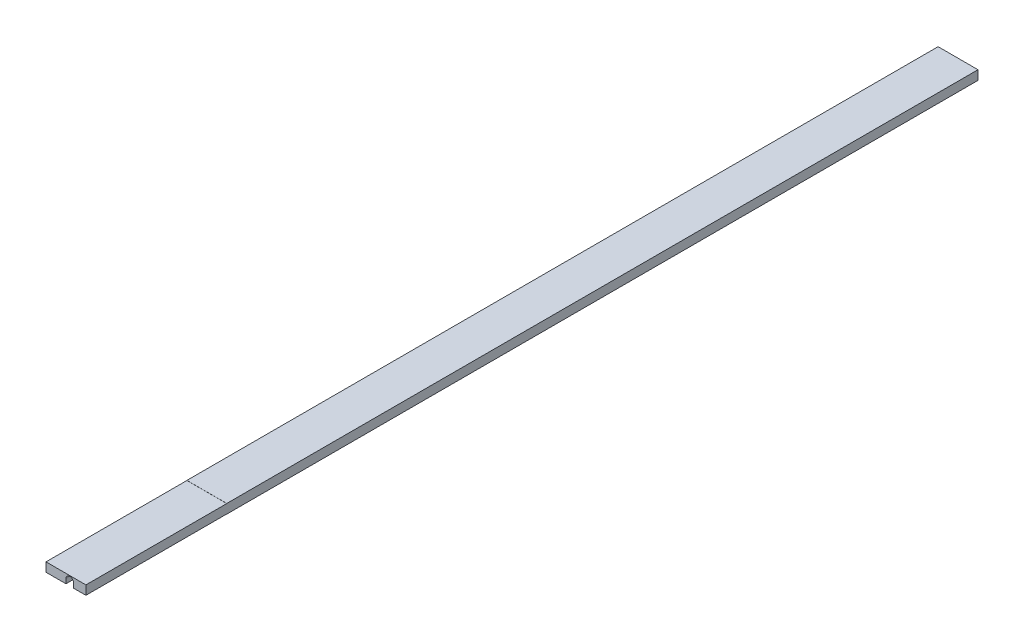
ISO-10303-21;
HEADER;
FILE_DESCRIPTION(('STEP AP214'),'2;1');
FILE_NAME('part.step','',(''),(''),'','','');
FILE_SCHEMA(('AUTOMOTIVE_DESIGN { 1 0 10303 214 1 1 1 1 }'));
ENDSEC;
DATA;
#1=APPLICATION_CONTEXT('core data for automotive mechanical design processes');
#2=APPLICATION_PROTOCOL_DEFINITION('international standard','automotive_design',2000,#1);
#3=PRODUCT_CONTEXT('',#1,'mechanical');
#4=PRODUCT('Part','Part','',(#3));
#5=PRODUCT_RELATED_PRODUCT_CATEGORY('part','',(#4));
#6=PRODUCT_DEFINITION_FORMATION('','',#4);
#7=PRODUCT_DEFINITION_CONTEXT('part definition',#1,'design');
#8=PRODUCT_DEFINITION('design','',#6,#7);
#9=PRODUCT_DEFINITION_SHAPE('','',#8);
#10=(LENGTH_UNIT() NAMED_UNIT(*) SI_UNIT(.MILLI.,.METRE.));
#11=(NAMED_UNIT(*) PLANE_ANGLE_UNIT() SI_UNIT($,.RADIAN.));
#12=(NAMED_UNIT(*) SI_UNIT($,.STERADIAN.) SOLID_ANGLE_UNIT());
#13=UNCERTAINTY_MEASURE_WITH_UNIT(LENGTH_MEASURE(1.E-05),#10,'distance_accuracy_value','');
#14=(GEOMETRIC_REPRESENTATION_CONTEXT(3) GLOBAL_UNCERTAINTY_ASSIGNED_CONTEXT((#13)) GLOBAL_UNIT_ASSIGNED_CONTEXT((#10,
#11,#12)) REPRESENTATION_CONTEXT('',''));
#15=CARTESIAN_POINT('',(0.,0.,0.));
#16=DIRECTION('',(0.,0.,1.));
#17=DIRECTION('',(1.,0.,0.));
#18=AXIS2_PLACEMENT_3D('',#15,#16,#17);
#19=CARTESIAN_POINT('',(-12.5,-2.9,259.4));
#20=DIRECTION('',(0.,1.,0.));
#21=DIRECTION('',(0.,0.,1.));
#22=AXIS2_PLACEMENT_3D('',#19,#20,#21);
#23=PLANE('',#22);
#24=DIRECTION('',(0.,0.,-1.));
#25=VECTOR('',#24,1.);
#26=CARTESIAN_POINT('',(12.5,-2.9,259.4));
#27=LINE('',#26,#25);
#28=CARTESIAN_POINT('',(12.5,-2.90000000000001,191.15));
#29=VERTEX_POINT('',#28);
#30=CARTESIAN_POINT('',(12.5,-2.9,-279.4));
#31=VERTEX_POINT('',#30);
#32=EDGE_CURVE('E172',#29,#31,#27,.T.);
#33=ORIENTED_EDGE('',*,*,#32,.F.);
#34=DIRECTION('',(-1.,0.,0.));
#35=VECTOR('',#34,1.);
#36=CARTESIAN_POINT('',(12.5,-2.90000000000001,191.15));
#37=LINE('',#36,#35);
#38=CARTESIAN_POINT('',(4.76224999999999,-2.90000000000001,191.15));
#39=VERTEX_POINT('',#38);
#40=EDGE_CURVE('E205',#29,#39,#37,.T.);
#41=ORIENTED_EDGE('',*,*,#40,.T.);
#42=DIRECTION('',(0.,0.,1.));
#43=VECTOR('',#42,1.);
#44=CARTESIAN_POINT('',(4.76224999999999,-2.9,-279.4));
#45=LINE('',#44,#43);
#46=CARTESIAN_POINT('',(4.76224999999999,-2.9,-279.4));
#47=VERTEX_POINT('',#46);
#48=EDGE_CURVE('E238',#47,#39,#45,.T.);
#49=ORIENTED_EDGE('',*,*,#48,.F.);
#50=DIRECTION('',(1.,0.,0.));
#51=VECTOR('',#50,1.);
#52=CARTESIAN_POINT('',(-12.5,-2.9,-279.4));
#53=LINE('',#52,#51);
#54=EDGE_CURVE('E173',#47,#31,#53,.T.);
#55=ORIENTED_EDGE('',*,*,#54,.T.);
#56=EDGE_LOOP('',(#33,#41,#49,#55));
#57=FACE_BOUND('',#56,.T.);
#58=ADVANCED_FACE('F34',(#57),#23,.F.);
#59=CARTESIAN_POINT('',(12.5,2.9,259.4));
#60=DIRECTION('',(-1.,0.,0.));
#61=DIRECTION('',(0.,0.,1.));
#62=AXIS2_PLACEMENT_3D('',#59,#60,#61);
#63=PLANE('',#62);
#64=DIRECTION('',(0.,0.,-1.));
#65=VECTOR('',#64,1.);
#66=CARTESIAN_POINT('',(12.5,-2.83142,279.4));
#67=LINE('',#66,#65);
#68=CARTESIAN_POINT('',(12.5,-2.83142,279.4));
#69=VERTEX_POINT('',#68);
#70=CARTESIAN_POINT('',(12.5,-2.83142000000001,191.15));
#71=VERTEX_POINT('',#70);
#72=EDGE_CURVE('E133',#69,#71,#67,.T.);
#73=ORIENTED_EDGE('',*,*,#72,.T.);
#74=DIRECTION('',(0.,-1.,0.));
#75=VECTOR('',#74,1.);
#76=CARTESIAN_POINT('',(12.5,-2.90000000000001,191.15));
#77=LINE('',#76,#75);
#78=EDGE_CURVE('E141',#71,#29,#77,.T.);
#79=ORIENTED_EDGE('',*,*,#78,.T.);
#80=ORIENTED_EDGE('',*,*,#32,.T.);
#81=DIRECTION('',(0.,1.,0.));
#82=VECTOR('',#81,1.);
#83=CARTESIAN_POINT('',(12.5,-34.9156211871643,-279.4));
#84=LINE('',#83,#82);
#85=CARTESIAN_POINT('',(12.5,2.9,-279.4));
#86=VERTEX_POINT('',#85);
#87=EDGE_CURVE('E162',#31,#86,#84,.T.);
#88=ORIENTED_EDGE('',*,*,#87,.T.);
#89=DIRECTION('',(0.,0.,-1.));
#90=VECTOR('',#89,1.);
#91=CARTESIAN_POINT('',(12.5,2.9,259.4));
#92=LINE('',#91,#90);
#93=CARTESIAN_POINT('',(12.5,2.89999999999999,191.15));
#94=VERTEX_POINT('',#93);
#95=EDGE_CURVE('E185',#94,#86,#92,.T.);
#96=ORIENTED_EDGE('',*,*,#95,.F.);
#97=DIRECTION('',(0.,-1.,0.));
#98=VECTOR('',#97,1.);
#99=CARTESIAN_POINT('',(12.5,2.89999999999999,191.15));
#100=LINE('',#99,#98);
#101=CARTESIAN_POINT('',(12.5,2.83141999999999,191.15));
#102=VERTEX_POINT('',#101);
#103=EDGE_CURVE('E209',#94,#102,#100,.T.);
#104=ORIENTED_EDGE('',*,*,#103,.T.);
#105=DIRECTION('',(0.,0.,1.));
#106=VECTOR('',#105,1.);
#107=CARTESIAN_POINT('',(12.5,2.83142,279.4));
#108=LINE('',#107,#106);
#109=CARTESIAN_POINT('',(12.5,2.83142,279.4));
#110=VERTEX_POINT('',#109);
#111=EDGE_CURVE('E157',#102,#110,#108,.T.);
#112=ORIENTED_EDGE('',*,*,#111,.T.);
#113=DIRECTION('',(0.,1.,0.));
#114=VECTOR('',#113,1.);
#115=CARTESIAN_POINT('',(12.5,-34.9156211871643,279.4));
#116=LINE('',#115,#114);
#117=EDGE_CURVE('E148',#69,#110,#116,.T.);
#118=ORIENTED_EDGE('',*,*,#117,.F.);
#119=EDGE_LOOP('',(#73,#79,#80,#88,#96,#104,#112,#118));
#120=FACE_BOUND('',#119,.T.);
#121=ADVANCED_FACE('F36',(#120),#63,.F.);
#122=CARTESIAN_POINT('',(-12.5,2.9,259.4));
#123=DIRECTION('',(0.,-1.,0.));
#124=DIRECTION('',(0.,0.,-1.));
#125=AXIS2_PLACEMENT_3D('',#122,#123,#124);
#126=PLANE('',#125);
#127=DIRECTION('',(0.,0.,-1.));
#128=VECTOR('',#127,1.);
#129=CARTESIAN_POINT('',(-12.5,2.9,259.4));
#130=LINE('',#129,#128);
#131=CARTESIAN_POINT('',(-12.5,2.89999999999999,191.15));
#132=VERTEX_POINT('',#131);
#133=CARTESIAN_POINT('',(-12.5,2.9,-279.4));
#134=VERTEX_POINT('',#133);
#135=EDGE_CURVE('E183',#132,#134,#130,.T.);
#136=ORIENTED_EDGE('',*,*,#135,.F.);
#137=DIRECTION('',(-1.,0.,0.));
#138=VECTOR('',#137,1.);
#139=CARTESIAN_POINT('',(12.5,2.89999999999999,191.15));
#140=LINE('',#139,#138);
#141=EDGE_CURVE('E213',#94,#132,#140,.T.);
#142=ORIENTED_EDGE('',*,*,#141,.F.);
#143=ORIENTED_EDGE('',*,*,#95,.T.);
#144=DIRECTION('',(-1.,0.,0.));
#145=VECTOR('',#144,1.);
#146=CARTESIAN_POINT('',(-12.5,2.9,-279.4));
#147=LINE('',#146,#145);
#148=EDGE_CURVE('E158',#86,#134,#147,.T.);
#149=ORIENTED_EDGE('',*,*,#148,.T.);
#150=EDGE_LOOP('',(#136,#142,#143,#149));
#151=FACE_BOUND('',#150,.T.);
#152=ADVANCED_FACE('F276',(#151),#126,.F.);
#153=CARTESIAN_POINT('',(-12.5,2.9,259.4));
#154=DIRECTION('',(1.,0.,0.));
#155=DIRECTION('',(0.,0.,-1.));
#156=AXIS2_PLACEMENT_3D('',#153,#154,#155);
#157=PLANE('',#156);
#158=DIRECTION('',(0.,0.,-1.));
#159=VECTOR('',#158,1.);
#160=CARTESIAN_POINT('',(-12.5,-2.9,259.4));
#161=LINE('',#160,#159);
#162=CARTESIAN_POINT('',(-12.5,-2.90000000000001,191.15));
#163=VERTEX_POINT('',#162);
#164=CARTESIAN_POINT('',(-12.5,-2.9,-279.4));
#165=VERTEX_POINT('',#164);
#166=EDGE_CURVE('E181',#163,#165,#161,.T.);
#167=ORIENTED_EDGE('',*,*,#166,.F.);
#168=DIRECTION('',(0.,-1.,0.));
#169=VECTOR('',#168,1.);
#170=CARTESIAN_POINT('',(-12.5,-2.90000000000001,191.15));
#171=LINE('',#170,#169);
#172=CARTESIAN_POINT('',(-12.5,-2.83142000000001,191.15));
#173=VERTEX_POINT('',#172);
#174=EDGE_CURVE('E142',#173,#163,#171,.T.);
#175=ORIENTED_EDGE('',*,*,#174,.F.);
#176=DIRECTION('',(0.,0.,-1.));
#177=VECTOR('',#176,1.);
#178=CARTESIAN_POINT('',(-12.5,-2.83142,279.4));
#179=LINE('',#178,#177);
#180=CARTESIAN_POINT('',(-12.5,-2.83142,279.4));
#181=VERTEX_POINT('',#180);
#182=EDGE_CURVE('E257',#181,#173,#179,.T.);
#183=ORIENTED_EDGE('',*,*,#182,.F.);
#184=DIRECTION('',(0.,1.,0.));
#185=VECTOR('',#184,1.);
#186=CARTESIAN_POINT('',(-12.5,-34.9156211871643,279.4));
#187=LINE('',#186,#185);
#188=CARTESIAN_POINT('',(-12.5,2.83141999999999,279.4));
#189=VERTEX_POINT('',#188);
#190=EDGE_CURVE('E159',#181,#189,#187,.T.);
#191=ORIENTED_EDGE('',*,*,#190,.T.);
#192=DIRECTION('',(0.,0.,1.));
#193=VECTOR('',#192,1.);
#194=CARTESIAN_POINT('',(-12.5,2.83142,279.4));
#195=LINE('',#194,#193);
#196=CARTESIAN_POINT('',(-12.5,2.83141999999999,191.15));
#197=VERTEX_POINT('',#196);
#198=EDGE_CURVE('E211',#197,#189,#195,.T.);
#199=ORIENTED_EDGE('',*,*,#198,.F.);
#200=DIRECTION('',(0.,-1.,0.));
#201=VECTOR('',#200,1.);
#202=CARTESIAN_POINT('',(-12.5,2.89999999999999,191.15));
#203=LINE('',#202,#201);
#204=EDGE_CURVE('E208',#132,#197,#203,.T.);
#205=ORIENTED_EDGE('',*,*,#204,.F.);
#206=ORIENTED_EDGE('',*,*,#135,.T.);
#207=DIRECTION('',(0.,1.,0.));
#208=VECTOR('',#207,1.);
#209=CARTESIAN_POINT('',(-12.5,-34.9156211871643,-279.4));
#210=LINE('',#209,#208);
#211=EDGE_CURVE('E175',#165,#134,#210,.T.);
#212=ORIENTED_EDGE('',*,*,#211,.F.);
#213=EDGE_LOOP('',(#167,#175,#183,#191,#199,#205,#206,#212));
#214=FACE_BOUND('',#213,.T.);
#215=ADVANCED_FACE('F261',(#214),#157,.F.);
#216=DIRECTION('',(0.,0.,1.));
#217=VECTOR('',#216,1.);
#218=CARTESIAN_POINT('',(-0.000250000000010734,-2.9,-279.4));
#219=LINE('',#218,#217);
#220=CARTESIAN_POINT('',(-0.000250000000010734,-2.9,-279.4));
#221=VERTEX_POINT('',#220);
#222=CARTESIAN_POINT('',(-0.000250000000010658,-2.90000000000001,191.15));
#223=VERTEX_POINT('',#222);
#224=EDGE_CURVE('E240',#221,#223,#219,.T.);
#225=ORIENTED_EDGE('',*,*,#224,.T.);
#226=EDGE_CURVE('E253',#223,#163,#37,.T.);
#227=ORIENTED_EDGE('',*,*,#226,.T.);
#228=ORIENTED_EDGE('',*,*,#166,.T.);
#229=EDGE_CURVE('E170',#165,#221,#53,.T.);
#230=ORIENTED_EDGE('',*,*,#229,.T.);
#231=EDGE_LOOP('',(#225,#227,#228,#230));
#232=FACE_BOUND('',#231,.T.);
#233=ADVANCED_FACE('F295',(#232),#23,.F.);
#234=CARTESIAN_POINT('',(-12.5,-34.9156211871643,-279.4));
#235=DIRECTION('',(0.,0.,-1.));
#236=DIRECTION('',(-1.,0.,0.));
#237=AXIS2_PLACEMENT_3D('',#234,#235,#236);
#238=PLANE('',#237);
#239=DIRECTION('',(0.,1.,0.));
#240=VECTOR('',#239,1.);
#241=CARTESIAN_POINT('',(4.76224999999999,-2.9,-279.4));
#242=LINE('',#241,#240);
#243=CARTESIAN_POINT('',(4.76224999999999,0.0221999999999999,-279.4));
#244=VERTEX_POINT('',#243);
#245=EDGE_CURVE('E230',#47,#244,#242,.T.);
#246=ORIENTED_EDGE('',*,*,#245,.T.);
#247=CARTESIAN_POINT('',(2.38099999999999,0.0221999999999999,-279.4));
#248=DIRECTION('',(0.,0.,1.));
#249=DIRECTION('',(1.,0.,0.));
#250=AXIS2_PLACEMENT_3D('',#247,#248,#249);
#251=CIRCLE('',#250,2.38125);
#252=CARTESIAN_POINT('',(-0.000250000000011092,0.0221999999999996,-279.4));
#253=VERTEX_POINT('',#252);
#254=EDGE_CURVE('E224',#244,#253,#251,.T.);
#255=ORIENTED_EDGE('',*,*,#254,.T.);
#256=DIRECTION('',(0.,-1.,0.));
#257=VECTOR('',#256,1.);
#258=CARTESIAN_POINT('',(-0.000250000000011092,0.0221999999999996,-279.4));
#259=LINE('',#258,#257);
#260=EDGE_CURVE('E227',#253,#221,#259,.T.);
#261=ORIENTED_EDGE('',*,*,#260,.T.);
#262=ORIENTED_EDGE('',*,*,#229,.F.);
#263=ORIENTED_EDGE('',*,*,#211,.T.);
#264=ORIENTED_EDGE('',*,*,#148,.F.);
#265=ORIENTED_EDGE('',*,*,#87,.F.);
#266=ORIENTED_EDGE('',*,*,#54,.F.);
#267=EDGE_LOOP('',(#246,#255,#261,#262,#263,#264,#265,#266));
#268=FACE_BOUND('',#267,.T.);
#269=ADVANCED_FACE('F272',(#268),#238,.T.);
#270=CARTESIAN_POINT('',(-12.5,-34.9156211871643,279.4));
#271=DIRECTION('',(0.,0.,1.));
#272=DIRECTION('',(1.,0.,0.));
#273=AXIS2_PLACEMENT_3D('',#270,#271,#272);
#274=PLANE('',#273);
#275=DIRECTION('',(-1.,0.,0.));
#276=VECTOR('',#275,1.);
#277=CARTESIAN_POINT('',(12.5,-2.83142,279.4));
#278=LINE('',#277,#276);
#279=CARTESIAN_POINT('',(4.76224999999999,-2.83142000000001,279.4));
#280=VERTEX_POINT('',#279);
#281=EDGE_CURVE('E49',#69,#280,#278,.T.);
#282=ORIENTED_EDGE('',*,*,#281,.F.);
#283=ORIENTED_EDGE('',*,*,#117,.T.);
#284=DIRECTION('',(-1.,0.,0.));
#285=VECTOR('',#284,1.);
#286=CARTESIAN_POINT('',(12.5,2.83142,279.4));
#287=LINE('',#286,#285);
#288=EDGE_CURVE('E218',#110,#189,#287,.T.);
#289=ORIENTED_EDGE('',*,*,#288,.T.);
#290=ORIENTED_EDGE('',*,*,#190,.F.);
#291=CARTESIAN_POINT('',(-0.000250000000010658,-2.83142,279.4));
#292=VERTEX_POINT('',#291);
#293=EDGE_CURVE('E152',#292,#181,#278,.T.);
#294=ORIENTED_EDGE('',*,*,#293,.F.);
#295=DIRECTION('',(0.,-1.,0.));
#296=VECTOR('',#295,1.);
#297=CARTESIAN_POINT('',(-0.000250000000011092,0.0221999999999996,279.4));
#298=LINE('',#297,#296);
#299=CARTESIAN_POINT('',(-0.000250000000011468,0.0222,279.4));
#300=VERTEX_POINT('',#299);
#301=EDGE_CURVE('E193',#300,#292,#298,.T.);
#302=ORIENTED_EDGE('',*,*,#301,.F.);
#303=CARTESIAN_POINT('',(2.38099999999999,0.0221999999999999,279.4));
#304=DIRECTION('',(0.,0.,1.));
#305=DIRECTION('',(1.,0.,0.));
#306=AXIS2_PLACEMENT_3D('',#303,#304,#305);
#307=CIRCLE('',#306,2.38125);
#308=CARTESIAN_POINT('',(4.76224999999999,0.0221999999999999,279.4));
#309=VERTEX_POINT('',#308);
#310=EDGE_CURVE('E220',#309,#300,#307,.T.);
#311=ORIENTED_EDGE('',*,*,#310,.F.);
#312=DIRECTION('',(0.,1.,0.));
#313=VECTOR('',#312,1.);
#314=CARTESIAN_POINT('',(4.76224999999999,-2.9,279.4));
#315=LINE('',#314,#313);
#316=EDGE_CURVE('E151',#280,#309,#315,.T.);
#317=ORIENTED_EDGE('',*,*,#316,.F.);
#318=EDGE_LOOP('',(#282,#283,#289,#290,#294,#302,#311,#317));
#319=FACE_BOUND('',#318,.T.);
#320=ADVANCED_FACE('F146',(#319),#274,.T.);
#321=CARTESIAN_POINT('',(2.38099999999999,0.0221999999999999,-279.4));
#322=DIRECTION('',(0.,0.,1.));
#323=DIRECTION('',(1.,0.,0.));
#324=AXIS2_PLACEMENT_3D('',#321,#322,#323);
#325=CYLINDRICAL_SURFACE('',#324,2.38125);
#326=ORIENTED_EDGE('',*,*,#310,.T.);
#327=DIRECTION('',(0.,0.,1.));
#328=VECTOR('',#327,1.);
#329=CARTESIAN_POINT('',(-0.000250000000011092,0.0221999999999996,-279.4));
#330=LINE('',#329,#328);
#331=EDGE_CURVE('E167',#253,#300,#330,.T.);
#332=ORIENTED_EDGE('',*,*,#331,.F.);
#333=ORIENTED_EDGE('',*,*,#254,.F.);
#334=DIRECTION('',(0.,0.,1.));
#335=VECTOR('',#334,1.);
#336=CARTESIAN_POINT('',(4.76224999999999,0.0221999999999999,-279.4));
#337=LINE('',#336,#335);
#338=EDGE_CURVE('E164',#244,#309,#337,.T.);
#339=ORIENTED_EDGE('',*,*,#338,.T.);
#340=EDGE_LOOP('',(#326,#332,#333,#339));
#341=FACE_BOUND('',#340,.T.);
#342=ADVANCED_FACE('F246',(#341),#325,.F.);
#343=CARTESIAN_POINT('',(4.76224999999999,-2.9,-279.4));
#344=DIRECTION('',(1.,0.,0.));
#345=DIRECTION('',(0.,1.,0.));
#346=AXIS2_PLACEMENT_3D('',#343,#344,#345);
#347=PLANE('',#346);
#348=ORIENTED_EDGE('',*,*,#48,.T.);
#349=DIRECTION('',(0.,1.,0.));
#350=VECTOR('',#349,1.);
#351=CARTESIAN_POINT('',(4.76224999999999,-2.9,191.15));
#352=LINE('',#351,#350);
#353=CARTESIAN_POINT('',(4.76224999999999,-2.83142000000001,191.15));
#354=VERTEX_POINT('',#353);
#355=EDGE_CURVE('E204',#39,#354,#352,.T.);
#356=ORIENTED_EDGE('',*,*,#355,.T.);
#357=DIRECTION('',(0.,0.,1.));
#358=VECTOR('',#357,1.);
#359=CARTESIAN_POINT('',(4.76224999999999,-2.83142000000007,-279.4));
#360=LINE('',#359,#358);
#361=EDGE_CURVE('E202',#354,#280,#360,.T.);
#362=ORIENTED_EDGE('',*,*,#361,.T.);
#363=ORIENTED_EDGE('',*,*,#316,.T.);
#364=ORIENTED_EDGE('',*,*,#338,.F.);
#365=ORIENTED_EDGE('',*,*,#245,.F.);
#366=EDGE_LOOP('',(#348,#356,#362,#363,#364,#365));
#367=FACE_BOUND('',#366,.T.);
#368=ADVANCED_FACE('F248',(#367),#347,.F.);
#369=CARTESIAN_POINT('',(-0.000250000000011092,0.0221999999999996,-279.4));
#370=DIRECTION('',(-1.,0.,0.));
#371=DIRECTION('',(0.,-1.,0.));
#372=AXIS2_PLACEMENT_3D('',#369,#370,#371);
#373=PLANE('',#372);
#374=DIRECTION('',(0.,0.,-1.));
#375=VECTOR('',#374,1.);
#376=CARTESIAN_POINT('',(-0.000250000000010743,-2.83142000000007,-279.4));
#377=LINE('',#376,#375);
#378=CARTESIAN_POINT('',(-0.000250000000010743,-2.83142000000001,191.15));
#379=VERTEX_POINT('',#378);
#380=EDGE_CURVE('E42',#292,#379,#377,.T.);
#381=ORIENTED_EDGE('',*,*,#380,.T.);
#382=DIRECTION('',(0.,-1.,0.));
#383=VECTOR('',#382,1.);
#384=CARTESIAN_POINT('',(-0.000250000000011092,0.0221999999999996,191.15));
#385=LINE('',#384,#383);
#386=EDGE_CURVE('E11',#379,#223,#385,.T.);
#387=ORIENTED_EDGE('',*,*,#386,.T.);
#388=ORIENTED_EDGE('',*,*,#224,.F.);
#389=ORIENTED_EDGE('',*,*,#260,.F.);
#390=ORIENTED_EDGE('',*,*,#331,.T.);
#391=ORIENTED_EDGE('',*,*,#301,.T.);
#392=EDGE_LOOP('',(#381,#387,#388,#389,#390,#391));
#393=FACE_BOUND('',#392,.T.);
#394=ADVANCED_FACE('F189',(#393),#373,.F.);
#395=CARTESIAN_POINT('',(12.5,2.83142,279.4));
#396=DIRECTION('',(0.,-1.,0.));
#397=DIRECTION('',(0.,0.,-1.));
#398=AXIS2_PLACEMENT_3D('',#395,#396,#397);
#399=PLANE('',#398);
#400=ORIENTED_EDGE('',*,*,#198,.T.);
#401=ORIENTED_EDGE('',*,*,#288,.F.);
#402=ORIENTED_EDGE('',*,*,#111,.F.);
#403=DIRECTION('',(-1.,0.,0.));
#404=VECTOR('',#403,1.);
#405=CARTESIAN_POINT('',(12.5,2.83141999999999,191.15));
#406=LINE('',#405,#404);
#407=EDGE_CURVE('E221',#102,#197,#406,.T.);
#408=ORIENTED_EDGE('',*,*,#407,.T.);
#409=EDGE_LOOP('',(#400,#401,#402,#408));
#410=FACE_BOUND('',#409,.T.);
#411=ADVANCED_FACE('F283',(#410),#399,.F.);
#412=CARTESIAN_POINT('',(12.5,2.89999999999999,191.15));
#413=DIRECTION('',(0.,0.,-1.));
#414=DIRECTION('',(-1.,0.,0.));
#415=AXIS2_PLACEMENT_3D('',#412,#413,#414);
#416=PLANE('',#415);
#417=ORIENTED_EDGE('',*,*,#204,.T.);
#418=ORIENTED_EDGE('',*,*,#407,.F.);
#419=ORIENTED_EDGE('',*,*,#103,.F.);
#420=ORIENTED_EDGE('',*,*,#141,.T.);
#421=EDGE_LOOP('',(#417,#418,#419,#420));
#422=FACE_BOUND('',#421,.T.);
#423=ADVANCED_FACE('F279',(#422),#416,.F.);
#424=CARTESIAN_POINT('',(12.5,-2.83142,279.4));
#425=DIRECTION('',(0.,1.,0.));
#426=DIRECTION('',(0.,0.,1.));
#427=AXIS2_PLACEMENT_3D('',#424,#425,#426);
#428=PLANE('',#427);
#429=ORIENTED_EDGE('',*,*,#293,.T.);
#430=ORIENTED_EDGE('',*,*,#182,.T.);
#431=DIRECTION('',(-1.,0.,0.));
#432=VECTOR('',#431,1.);
#433=CARTESIAN_POINT('',(12.5,-2.83142000000001,191.15));
#434=LINE('',#433,#432);
#435=EDGE_CURVE('E57',#379,#173,#434,.T.);
#436=ORIENTED_EDGE('',*,*,#435,.F.);
#437=ORIENTED_EDGE('',*,*,#380,.F.);
#438=EDGE_LOOP('',(#429,#430,#436,#437));
#439=FACE_BOUND('',#438,.T.);
#440=ADVANCED_FACE('F195',(#439),#428,.F.);
#441=CARTESIAN_POINT('',(12.5,-2.90000000000001,191.15));
#442=DIRECTION('',(0.,0.,-1.));
#443=DIRECTION('',(-1.,0.,0.));
#444=AXIS2_PLACEMENT_3D('',#441,#442,#443);
#445=PLANE('',#444);
#446=ORIENTED_EDGE('',*,*,#435,.T.);
#447=ORIENTED_EDGE('',*,*,#174,.T.);
#448=ORIENTED_EDGE('',*,*,#226,.F.);
#449=ORIENTED_EDGE('',*,*,#386,.F.);
#450=EDGE_LOOP('',(#446,#447,#448,#449));
#451=FACE_BOUND('',#450,.T.);
#452=ADVANCED_FACE('F255',(#451),#445,.F.);
#453=ORIENTED_EDGE('',*,*,#40,.F.);
#454=ORIENTED_EDGE('',*,*,#78,.F.);
#455=EDGE_CURVE('E136',#71,#354,#434,.T.);
#456=ORIENTED_EDGE('',*,*,#455,.T.);
#457=ORIENTED_EDGE('',*,*,#355,.F.);
#458=EDGE_LOOP('',(#453,#454,#456,#457));
#459=FACE_BOUND('',#458,.T.);
#460=ADVANCED_FACE('F251',(#459),#445,.F.);
#461=ORIENTED_EDGE('',*,*,#455,.F.);
#462=ORIENTED_EDGE('',*,*,#72,.F.);
#463=ORIENTED_EDGE('',*,*,#281,.T.);
#464=ORIENTED_EDGE('',*,*,#361,.F.);
#465=EDGE_LOOP('',(#461,#462,#463,#464));
#466=FACE_BOUND('',#465,.T.);
#467=ADVANCED_FACE('F134',(#466),#428,.F.);
#468=CLOSED_SHELL('',(#58,#121,#152,#215,#233,#269,#320,#342,#368,#394,#411,#423,#440,#452,#460,#467));
#469=MANIFOLD_SOLID_BREP('B2',#468);
#470=ADVANCED_BREP_SHAPE_REPRESENTATION('',(#18,#469),#14);
#471=SHAPE_DEFINITION_REPRESENTATION(#9,#470);
ENDSEC;
END-ISO-10303-21;
